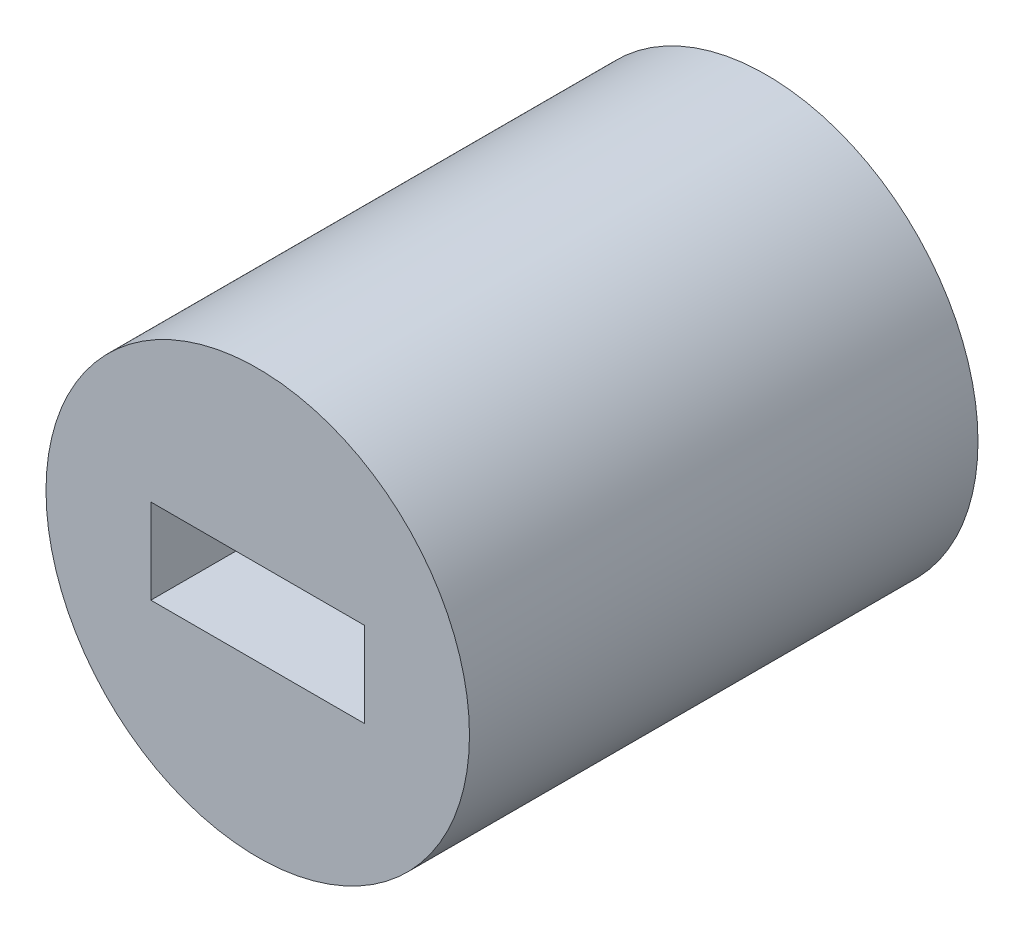
ISO-10303-21;
HEADER;
FILE_DESCRIPTION(('STEP AP214'),'2;1');
FILE_NAME('part.step','',(''),(''),'','','');
FILE_SCHEMA(('AUTOMOTIVE_DESIGN { 1 0 10303 214 1 1 1 1 }'));
ENDSEC;
DATA;
#1=APPLICATION_CONTEXT('core data for automotive mechanical design processes');
#2=APPLICATION_PROTOCOL_DEFINITION('international standard','automotive_design',2000,#1);
#3=PRODUCT_CONTEXT('',#1,'mechanical');
#4=PRODUCT('Part','Part','',(#3));
#5=PRODUCT_RELATED_PRODUCT_CATEGORY('part','',(#4));
#6=PRODUCT_DEFINITION_FORMATION('','',#4);
#7=PRODUCT_DEFINITION_CONTEXT('part definition',#1,'design');
#8=PRODUCT_DEFINITION('design','',#6,#7);
#9=PRODUCT_DEFINITION_SHAPE('','',#8);
#10=(LENGTH_UNIT() NAMED_UNIT(*) SI_UNIT(.MILLI.,.METRE.));
#11=(NAMED_UNIT(*) PLANE_ANGLE_UNIT() SI_UNIT($,.RADIAN.));
#12=(NAMED_UNIT(*) SI_UNIT($,.STERADIAN.) SOLID_ANGLE_UNIT());
#13=UNCERTAINTY_MEASURE_WITH_UNIT(LENGTH_MEASURE(1.E-05),#10,'distance_accuracy_value','');
#14=(GEOMETRIC_REPRESENTATION_CONTEXT(3) GLOBAL_UNCERTAINTY_ASSIGNED_CONTEXT((#13)) GLOBAL_UNIT_ASSIGNED_CONTEXT((#10,
#11,#12)) REPRESENTATION_CONTEXT('',''));
#15=CARTESIAN_POINT('',(0.,0.,0.));
#16=DIRECTION('',(0.,0.,1.));
#17=DIRECTION('',(1.,0.,0.));
#18=AXIS2_PLACEMENT_3D('',#15,#16,#17);
#19=CARTESIAN_POINT('',(-0.64100581951225,0.,3.05));
#20=DIRECTION('',(1.,0.,0.));
#21=DIRECTION('',(0.,1.,0.));
#22=AXIS2_PLACEMENT_3D('',#19,#20,#21);
#23=PLANE('',#22);
#24=DIRECTION('',(0.,1.,0.));
#25=VECTOR('',#24,1.);
#26=CARTESIAN_POINT('',(-0.64100581951225,0.,1.55));
#27=LINE('',#26,#25);
#28=CARTESIAN_POINT('',(-0.64100581951225,0.255,1.55));
#29=VERTEX_POINT('',#28);
#30=CARTESIAN_POINT('',(-0.64100581951225,-0.255,1.55));
#31=VERTEX_POINT('',#30);
#32=EDGE_CURVE('E113',#29,#31,#27,.F.);
#33=ORIENTED_EDGE('',*,*,#32,.F.);
#34=DIRECTION('',(0.,0.,1.));
#35=VECTOR('',#34,1.);
#36=CARTESIAN_POINT('',(-0.64100581951225,0.255,3.05));
#37=LINE('',#36,#35);
#38=CARTESIAN_POINT('',(-0.64100581951225,0.255,3.05));
#39=VERTEX_POINT('',#38);
#40=EDGE_CURVE('E121',#39,#29,#37,.F.);
#41=ORIENTED_EDGE('',*,*,#40,.F.);
#42=DIRECTION('',(0.,1.,0.));
#43=VECTOR('',#42,1.);
#44=CARTESIAN_POINT('',(-0.64100581951225,0.,3.05));
#45=LINE('',#44,#43);
#46=CARTESIAN_POINT('',(-0.64100581951225,-0.255,3.05));
#47=VERTEX_POINT('',#46);
#48=EDGE_CURVE('E31',#39,#47,#45,.F.);
#49=ORIENTED_EDGE('',*,*,#48,.T.);
#50=DIRECTION('',(0.,0.,1.));
#51=VECTOR('',#50,1.);
#52=CARTESIAN_POINT('',(-0.64100581951225,-0.255,3.05));
#53=LINE('',#52,#51);
#54=EDGE_CURVE('E118',#31,#47,#53,.T.);
#55=ORIENTED_EDGE('',*,*,#54,.F.);
#56=EDGE_LOOP('',(#33,#41,#49,#55));
#57=FACE_BOUND('',#56,.T.);
#58=ADVANCED_FACE('F15',(#57),#23,.T.);
#59=CARTESIAN_POINT('',(0.,0.,1.55));
#60=DIRECTION('',(0.,0.,1.));
#61=DIRECTION('',(1.,0.,0.));
#62=AXIS2_PLACEMENT_3D('',#59,#60,#61);
#63=PLANE('',#62);
#64=DIRECTION('',(-1.,0.,0.));
#65=VECTOR('',#64,1.);
#66=CARTESIAN_POINT('',(0.528723609904574,-0.255,1.55));
#67=LINE('',#66,#65);
#68=CARTESIAN_POINT('',(-0.416441400296898,-0.255,1.55));
#69=VERTEX_POINT('',#68);
#70=EDGE_CURVE('E126',#69,#31,#67,.T.);
#71=ORIENTED_EDGE('',*,*,#70,.F.);
#72=DIRECTION('',(0.,-1.,0.));
#73=VECTOR('',#72,1.);
#74=CARTESIAN_POINT('',(-0.416441400296898,0.,1.55));
#75=LINE('',#74,#73);
#76=CARTESIAN_POINT('',(-0.416441400296898,0.255,1.55));
#77=VERTEX_POINT('',#76);
#78=EDGE_CURVE('E111',#69,#77,#75,.F.);
#79=ORIENTED_EDGE('',*,*,#78,.T.);
#80=DIRECTION('',(1.,0.,0.));
#81=VECTOR('',#80,1.);
#82=CARTESIAN_POINT('',(-0.528723609904574,0.255,1.55));
#83=LINE('',#82,#81);
#84=EDGE_CURVE('E147',#29,#77,#83,.T.);
#85=ORIENTED_EDGE('',*,*,#84,.F.);
#86=ORIENTED_EDGE('',*,*,#32,.T.);
#87=EDGE_LOOP('',(#71,#79,#85,#86));
#88=FACE_BOUND('',#87,.T.);
#89=ADVANCED_FACE('F158',(#88),#63,.T.);
#90=CARTESIAN_POINT('',(-0.416441400296898,0.,3.05));
#91=DIRECTION('',(-1.,0.,0.));
#92=DIRECTION('',(0.,-1.,0.));
#93=AXIS2_PLACEMENT_3D('',#90,#91,#92);
#94=PLANE('',#93);
#95=DIRECTION('',(0.,0.,1.));
#96=VECTOR('',#95,1.);
#97=CARTESIAN_POINT('',(-0.416441400296898,0.255,3.05));
#98=LINE('',#97,#96);
#99=CARTESIAN_POINT('',(-0.416441400296898,0.255,0.));
#100=VERTEX_POINT('',#99);
#101=EDGE_CURVE('E144',#77,#100,#98,.F.);
#102=ORIENTED_EDGE('',*,*,#101,.F.);
#103=ORIENTED_EDGE('',*,*,#78,.F.);
#104=DIRECTION('',(0.,0.,1.));
#105=VECTOR('',#104,1.);
#106=CARTESIAN_POINT('',(-0.416441400296898,-0.255,3.05));
#107=LINE('',#106,#105);
#108=CARTESIAN_POINT('',(-0.416441400296898,-0.255,0.));
#109=VERTEX_POINT('',#108);
#110=EDGE_CURVE('E95',#109,#69,#107,.T.);
#111=ORIENTED_EDGE('',*,*,#110,.F.);
#112=DIRECTION('',(0.,-1.,0.));
#113=VECTOR('',#112,1.);
#114=CARTESIAN_POINT('',(-0.416441400296898,0.,0.));
#115=LINE('',#114,#113);
#116=EDGE_CURVE('E109',#100,#109,#115,.T.);
#117=ORIENTED_EDGE('',*,*,#116,.F.);
#118=EDGE_LOOP('',(#102,#103,#111,#117));
#119=FACE_BOUND('',#118,.T.);
#120=ADVANCED_FACE('F155',(#119),#94,.F.);
#121=CARTESIAN_POINT('',(0.416441400296898,0.,3.05));
#122=DIRECTION('',(1.,0.,0.));
#123=DIRECTION('',(0.,1.,0.));
#124=AXIS2_PLACEMENT_3D('',#121,#122,#123);
#125=PLANE('',#124);
#126=DIRECTION('',(0.,0.,1.));
#127=VECTOR('',#126,1.);
#128=CARTESIAN_POINT('',(0.416441400296898,-0.255,3.05));
#129=LINE('',#128,#127);
#130=CARTESIAN_POINT('',(0.416441400296898,-0.255,1.55));
#131=VERTEX_POINT('',#130);
#132=CARTESIAN_POINT('',(0.416441400296898,-0.255,0.));
#133=VERTEX_POINT('',#132);
#134=EDGE_CURVE('E90',#131,#133,#129,.F.);
#135=ORIENTED_EDGE('',*,*,#134,.F.);
#136=DIRECTION('',(0.,1.,0.));
#137=VECTOR('',#136,1.);
#138=CARTESIAN_POINT('',(0.416441400296898,0.,1.55));
#139=LINE('',#138,#137);
#140=CARTESIAN_POINT('',(0.416441400296898,0.255,1.55));
#141=VERTEX_POINT('',#140);
#142=EDGE_CURVE('E78',#141,#131,#139,.F.);
#143=ORIENTED_EDGE('',*,*,#142,.F.);
#144=DIRECTION('',(0.,0.,1.));
#145=VECTOR('',#144,1.);
#146=CARTESIAN_POINT('',(0.416441400296898,0.255,3.05));
#147=LINE('',#146,#145);
#148=CARTESIAN_POINT('',(0.416441400296898,0.255,0.));
#149=VERTEX_POINT('',#148);
#150=EDGE_CURVE('E142',#149,#141,#147,.T.);
#151=ORIENTED_EDGE('',*,*,#150,.F.);
#152=DIRECTION('',(0.,1.,0.));
#153=VECTOR('',#152,1.);
#154=CARTESIAN_POINT('',(0.416441400296898,0.,0.));
#155=LINE('',#154,#153);
#156=EDGE_CURVE('E87',#133,#149,#155,.T.);
#157=ORIENTED_EDGE('',*,*,#156,.F.);
#158=EDGE_LOOP('',(#135,#143,#151,#157));
#159=FACE_BOUND('',#158,.T.);
#160=ADVANCED_FACE('F91',(#159),#125,.F.);
#161=CARTESIAN_POINT('',(0.,0.,1.55));
#162=DIRECTION('',(0.,0.,1.));
#163=DIRECTION('',(1.,0.,0.));
#164=AXIS2_PLACEMENT_3D('',#161,#162,#163);
#165=PLANE('',#164);
#166=ORIENTED_EDGE('',*,*,#142,.T.);
#167=DIRECTION('',(-1.,0.,0.));
#168=VECTOR('',#167,1.);
#169=CARTESIAN_POINT('',(0.528723609904574,-0.255,1.55));
#170=LINE('',#169,#168);
#171=CARTESIAN_POINT('',(0.64100581951225,-0.255,1.55));
#172=VERTEX_POINT('',#171);
#173=EDGE_CURVE('E75',#172,#131,#170,.T.);
#174=ORIENTED_EDGE('',*,*,#173,.F.);
#175=DIRECTION('',(0.,-1.,0.));
#176=VECTOR('',#175,1.);
#177=CARTESIAN_POINT('',(0.64100581951225,0.,1.55));
#178=LINE('',#177,#176);
#179=CARTESIAN_POINT('',(0.64100581951225,0.255,1.55));
#180=VERTEX_POINT('',#179);
#181=EDGE_CURVE('E86',#180,#172,#178,.T.);
#182=ORIENTED_EDGE('',*,*,#181,.F.);
#183=DIRECTION('',(1.,0.,0.));
#184=VECTOR('',#183,1.);
#185=CARTESIAN_POINT('',(-0.528723609904574,0.255,1.55));
#186=LINE('',#185,#184);
#187=EDGE_CURVE('E82',#141,#180,#186,.T.);
#188=ORIENTED_EDGE('',*,*,#187,.F.);
#189=EDGE_LOOP('',(#166,#174,#182,#188));
#190=FACE_BOUND('',#189,.T.);
#191=ADVANCED_FACE('F80',(#190),#165,.T.);
#192=CARTESIAN_POINT('',(0.64100581951225,0.,3.05));
#193=DIRECTION('',(-1.,0.,0.));
#194=DIRECTION('',(0.,-1.,0.));
#195=AXIS2_PLACEMENT_3D('',#192,#193,#194);
#196=PLANE('',#195);
#197=DIRECTION('',(0.,-1.,0.));
#198=VECTOR('',#197,1.);
#199=CARTESIAN_POINT('',(0.64100581951225,0.,3.05));
#200=LINE('',#199,#198);
#201=CARTESIAN_POINT('',(0.64100581951225,-0.255,3.05));
#202=VERTEX_POINT('',#201);
#203=CARTESIAN_POINT('',(0.64100581951225,0.255,3.05));
#204=VERTEX_POINT('',#203);
#205=EDGE_CURVE('E102',#202,#204,#200,.F.);
#206=ORIENTED_EDGE('',*,*,#205,.T.);
#207=DIRECTION('',(0.,0.,1.));
#208=VECTOR('',#207,1.);
#209=CARTESIAN_POINT('',(0.64100581951225,0.255,3.05));
#210=LINE('',#209,#208);
#211=EDGE_CURVE('E138',#180,#204,#210,.T.);
#212=ORIENTED_EDGE('',*,*,#211,.F.);
#213=ORIENTED_EDGE('',*,*,#181,.T.);
#214=DIRECTION('',(0.,0.,1.));
#215=VECTOR('',#214,1.);
#216=CARTESIAN_POINT('',(0.64100581951225,-0.255,3.05));
#217=LINE('',#216,#215);
#218=EDGE_CURVE('E101',#202,#172,#217,.F.);
#219=ORIENTED_EDGE('',*,*,#218,.F.);
#220=EDGE_LOOP('',(#206,#212,#213,#219));
#221=FACE_BOUND('',#220,.T.);
#222=ADVANCED_FACE('F163',(#221),#196,.T.);
#223=CARTESIAN_POINT('',(0.528723609904574,-0.255,3.05));
#224=DIRECTION('',(0.,1.,0.));
#225=DIRECTION('',(-1.,0.,0.));
#226=AXIS2_PLACEMENT_3D('',#223,#224,#225);
#227=PLANE('',#226);
#228=DIRECTION('',(1.,0.,0.));
#229=VECTOR('',#228,1.);
#230=CARTESIAN_POINT('',(0.,-0.255,3.05));
#231=LINE('',#230,#229);
#232=EDGE_CURVE('E123',#202,#47,#231,.F.);
#233=ORIENTED_EDGE('',*,*,#232,.F.);
#234=ORIENTED_EDGE('',*,*,#218,.T.);
#235=ORIENTED_EDGE('',*,*,#173,.T.);
#236=ORIENTED_EDGE('',*,*,#134,.T.);
#237=DIRECTION('',(1.,0.,0.));
#238=VECTOR('',#237,1.);
#239=CARTESIAN_POINT('',(0.,-0.255,0.));
#240=LINE('',#239,#238);
#241=EDGE_CURVE('E134',#133,#109,#240,.F.);
#242=ORIENTED_EDGE('',*,*,#241,.T.);
#243=ORIENTED_EDGE('',*,*,#110,.T.);
#244=ORIENTED_EDGE('',*,*,#70,.T.);
#245=ORIENTED_EDGE('',*,*,#54,.T.);
#246=EDGE_LOOP('',(#233,#234,#235,#236,#242,#243,#244,#245));
#247=FACE_BOUND('',#246,.T.);
#248=ADVANCED_FACE('F99',(#247),#227,.T.);
#249=CARTESIAN_POINT('',(-0.528723609904574,0.255,3.05));
#250=DIRECTION('',(0.,-1.,0.));
#251=DIRECTION('',(1.,0.,0.));
#252=AXIS2_PLACEMENT_3D('',#249,#250,#251);
#253=PLANE('',#252);
#254=ORIENTED_EDGE('',*,*,#187,.T.);
#255=ORIENTED_EDGE('',*,*,#211,.T.);
#256=DIRECTION('',(1.,0.,0.));
#257=VECTOR('',#256,1.);
#258=CARTESIAN_POINT('',(0.,0.255,3.05));
#259=LINE('',#258,#257);
#260=EDGE_CURVE('E129',#39,#204,#259,.T.);
#261=ORIENTED_EDGE('',*,*,#260,.F.);
#262=ORIENTED_EDGE('',*,*,#40,.T.);
#263=ORIENTED_EDGE('',*,*,#84,.T.);
#264=ORIENTED_EDGE('',*,*,#101,.T.);
#265=DIRECTION('',(1.,0.,0.));
#266=VECTOR('',#265,1.);
#267=CARTESIAN_POINT('',(0.,0.255,0.));
#268=LINE('',#267,#266);
#269=EDGE_CURVE('E130',#100,#149,#268,.T.);
#270=ORIENTED_EDGE('',*,*,#269,.T.);
#271=ORIENTED_EDGE('',*,*,#150,.T.);
#272=EDGE_LOOP('',(#254,#255,#261,#262,#263,#264,#270,#271));
#273=FACE_BOUND('',#272,.T.);
#274=ADVANCED_FACE('F160',(#273),#253,.T.);
#275=CARTESIAN_POINT('',(0.,0.,0.));
#276=DIRECTION('',(0.,0.,1.));
#277=DIRECTION('',(1.,0.,0.));
#278=AXIS2_PLACEMENT_3D('',#275,#276,#277);
#279=PLANE('',#278);
#280=CARTESIAN_POINT('',(0.,0.,0.));
#281=DIRECTION('',(0.,0.,1.));
#282=DIRECTION('',(1.,0.,0.));
#283=AXIS2_PLACEMENT_3D('',#280,#281,#282);
#284=CIRCLE('',#283,1.27);
#285=CARTESIAN_POINT('',(1.27,0.,0.));
#286=VERTEX_POINT('',#285);
#287=EDGE_CURVE('E18',#286,#286,#284,.T.);
#288=ORIENTED_EDGE('',*,*,#287,.F.);
#289=EDGE_LOOP('',(#288));
#290=FACE_BOUND('',#289,.T.);
#291=ORIENTED_EDGE('',*,*,#116,.T.);
#292=ORIENTED_EDGE('',*,*,#241,.F.);
#293=ORIENTED_EDGE('',*,*,#156,.T.);
#294=ORIENTED_EDGE('',*,*,#269,.F.);
#295=EDGE_LOOP('',(#291,#292,#293,#294));
#296=FACE_BOUND('',#295,.T.);
#297=ADVANCED_FACE('F180',(#290,#296),#279,.F.);
#298=CARTESIAN_POINT('',(0.,0.,3.05));
#299=DIRECTION('',(0.,0.,1.));
#300=DIRECTION('',(1.,0.,0.));
#301=AXIS2_PLACEMENT_3D('',#298,#299,#300);
#302=PLANE('',#301);
#303=CARTESIAN_POINT('',(0.,0.,3.05));
#304=DIRECTION('',(0.,0.,1.));
#305=DIRECTION('',(1.,0.,0.));
#306=AXIS2_PLACEMENT_3D('',#303,#304,#305);
#307=CIRCLE('',#306,1.27);
#308=CARTESIAN_POINT('',(1.27,0.,3.05));
#309=VERTEX_POINT('',#308);
#310=EDGE_CURVE('E10',#309,#309,#307,.F.);
#311=ORIENTED_EDGE('',*,*,#310,.F.);
#312=EDGE_LOOP('',(#311));
#313=FACE_BOUND('',#312,.T.);
#314=ORIENTED_EDGE('',*,*,#48,.F.);
#315=ORIENTED_EDGE('',*,*,#260,.T.);
#316=ORIENTED_EDGE('',*,*,#205,.F.);
#317=ORIENTED_EDGE('',*,*,#232,.T.);
#318=EDGE_LOOP('',(#314,#315,#316,#317));
#319=FACE_BOUND('',#318,.T.);
#320=ADVANCED_FACE('F128',(#313,#319),#302,.T.);
#321=CARTESIAN_POINT('',(0.,0.,0.));
#322=DIRECTION('',(0.,0.,1.));
#323=DIRECTION('',(1.,0.,0.));
#324=AXIS2_PLACEMENT_3D('',#321,#322,#323);
#325=CYLINDRICAL_SURFACE('',#324,1.27);
#326=ORIENTED_EDGE('',*,*,#287,.T.);
#327=EDGE_LOOP('',(#326));
#328=FACE_BOUND('',#327,.T.);
#329=ORIENTED_EDGE('',*,*,#310,.T.);
#330=EDGE_LOOP('',(#329));
#331=FACE_BOUND('',#330,.T.);
#332=ADVANCED_FACE('F173',(#328,#331),#325,.T.);
#333=CLOSED_SHELL('',(#58,#89,#120,#160,#191,#222,#248,#274,#297,#320,#332));
#334=MANIFOLD_SOLID_BREP('B1',#333);
#335=ADVANCED_BREP_SHAPE_REPRESENTATION('',(#18,#334),#14);
#336=SHAPE_DEFINITION_REPRESENTATION(#9,#335);
ENDSEC;
END-ISO-10303-21;
